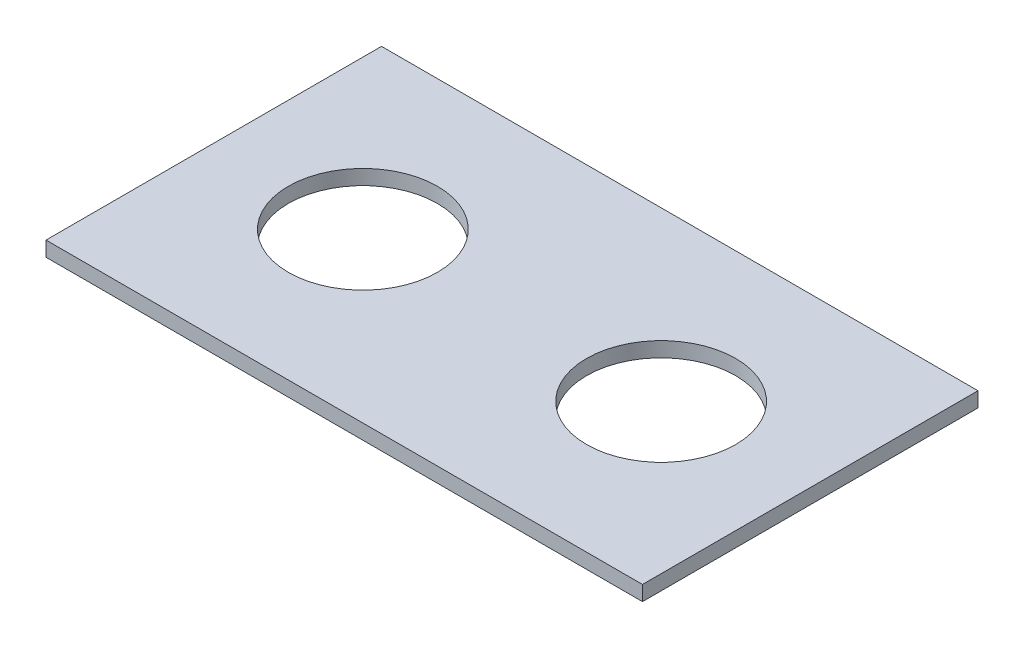
ISO-10303-21;
HEADER;
FILE_DESCRIPTION(('STEP AP214'),'2;1');
FILE_NAME('part.step','',(''),(''),'','','');
FILE_SCHEMA(('AUTOMOTIVE_DESIGN { 1 0 10303 214 1 1 1 1 }'));
ENDSEC;
DATA;
#1=APPLICATION_CONTEXT('core data for automotive mechanical design processes');
#2=APPLICATION_PROTOCOL_DEFINITION('international standard','automotive_design',2000,#1);
#3=PRODUCT_CONTEXT('',#1,'mechanical');
#4=PRODUCT('Part','Part','',(#3));
#5=PRODUCT_RELATED_PRODUCT_CATEGORY('part','',(#4));
#6=PRODUCT_DEFINITION_FORMATION('','',#4);
#7=PRODUCT_DEFINITION_CONTEXT('part definition',#1,'design');
#8=PRODUCT_DEFINITION('design','',#6,#7);
#9=PRODUCT_DEFINITION_SHAPE('','',#8);
#10=(LENGTH_UNIT() NAMED_UNIT(*) SI_UNIT(.MILLI.,.METRE.));
#11=(NAMED_UNIT(*) PLANE_ANGLE_UNIT() SI_UNIT($,.RADIAN.));
#12=(NAMED_UNIT(*) SI_UNIT($,.STERADIAN.) SOLID_ANGLE_UNIT());
#13=UNCERTAINTY_MEASURE_WITH_UNIT(LENGTH_MEASURE(1.E-05),#10,'distance_accuracy_value','');
#14=(GEOMETRIC_REPRESENTATION_CONTEXT(3) GLOBAL_UNCERTAINTY_ASSIGNED_CONTEXT((#13)) GLOBAL_UNIT_ASSIGNED_CONTEXT((#10,
#11,#12)) REPRESENTATION_CONTEXT('',''));
#15=CARTESIAN_POINT('',(0.,0.,0.));
#16=DIRECTION('',(0.,0.,1.));
#17=DIRECTION('',(1.,0.,0.));
#18=AXIS2_PLACEMENT_3D('',#15,#16,#17);
#19=CARTESIAN_POINT('',(-50.8,2.54,28.575));
#20=DIRECTION('',(0.,0.,-1.));
#21=DIRECTION('',(-1.,0.,0.));
#22=AXIS2_PLACEMENT_3D('',#19,#20,#21);
#23=PLANE('',#22);
#24=DIRECTION('',(1.,0.,0.));
#25=VECTOR('',#24,1.);
#26=CARTESIAN_POINT('',(-50.8,0.,28.575));
#27=LINE('',#26,#25);
#28=CARTESIAN_POINT('',(-50.8,0.,28.575));
#29=VERTEX_POINT('',#28);
#30=CARTESIAN_POINT('',(50.8,0.,28.575));
#31=VERTEX_POINT('',#30);
#32=EDGE_CURVE('E111',#29,#31,#27,.T.);
#33=ORIENTED_EDGE('',*,*,#32,.T.);
#34=DIRECTION('',(0.,-1.,0.));
#35=VECTOR('',#34,1.);
#36=CARTESIAN_POINT('',(50.8,2.54,28.575));
#37=LINE('',#36,#35);
#38=CARTESIAN_POINT('',(50.8,2.54,28.575));
#39=VERTEX_POINT('',#38);
#40=EDGE_CURVE('E11',#39,#31,#37,.T.);
#41=ORIENTED_EDGE('',*,*,#40,.F.);
#42=DIRECTION('',(1.,0.,0.));
#43=VECTOR('',#42,1.);
#44=CARTESIAN_POINT('',(-50.8,2.54,28.575));
#45=LINE('',#44,#43);
#46=CARTESIAN_POINT('',(-50.8,2.54,28.575));
#47=VERTEX_POINT('',#46);
#48=EDGE_CURVE('E92',#47,#39,#45,.T.);
#49=ORIENTED_EDGE('',*,*,#48,.F.);
#50=DIRECTION('',(0.,-1.,0.));
#51=VECTOR('',#50,1.);
#52=CARTESIAN_POINT('',(-50.8,2.54,28.575));
#53=LINE('',#52,#51);
#54=EDGE_CURVE('E59',#47,#29,#53,.T.);
#55=ORIENTED_EDGE('',*,*,#54,.T.);
#56=EDGE_LOOP('',(#33,#41,#49,#55));
#57=FACE_BOUND('',#56,.T.);
#58=ADVANCED_FACE('F42',(#57),#23,.F.);
#59=CARTESIAN_POINT('',(50.8,2.54,28.575));
#60=DIRECTION('',(-1.,0.,0.));
#61=DIRECTION('',(0.,0.,1.));
#62=AXIS2_PLACEMENT_3D('',#59,#60,#61);
#63=PLANE('',#62);
#64=DIRECTION('',(0.,0.,-1.));
#65=VECTOR('',#64,1.);
#66=CARTESIAN_POINT('',(50.8,0.,28.575));
#67=LINE('',#66,#65);
#68=CARTESIAN_POINT('',(50.8,0.,-28.575));
#69=VERTEX_POINT('',#68);
#70=EDGE_CURVE('E98',#31,#69,#67,.T.);
#71=ORIENTED_EDGE('',*,*,#70,.T.);
#72=DIRECTION('',(0.,-1.,0.));
#73=VECTOR('',#72,1.);
#74=CARTESIAN_POINT('',(50.8,2.54,-28.575));
#75=LINE('',#74,#73);
#76=CARTESIAN_POINT('',(50.8,2.54,-28.575));
#77=VERTEX_POINT('',#76);
#78=EDGE_CURVE('E51',#77,#69,#75,.T.);
#79=ORIENTED_EDGE('',*,*,#78,.F.);
#80=DIRECTION('',(0.,0.,-1.));
#81=VECTOR('',#80,1.);
#82=CARTESIAN_POINT('',(50.8,2.54,28.575));
#83=LINE('',#82,#81);
#84=EDGE_CURVE('E84',#39,#77,#83,.T.);
#85=ORIENTED_EDGE('',*,*,#84,.F.);
#86=ORIENTED_EDGE('',*,*,#40,.T.);
#87=EDGE_LOOP('',(#71,#79,#85,#86));
#88=FACE_BOUND('',#87,.T.);
#89=ADVANCED_FACE('F97',(#88),#63,.F.);
#90=CARTESIAN_POINT('',(-50.8,2.54,-28.575));
#91=DIRECTION('',(0.,0.,-1.));
#92=DIRECTION('',(-1.,0.,0.));
#93=AXIS2_PLACEMENT_3D('',#90,#91,#92);
#94=PLANE('',#93);
#95=DIRECTION('',(1.,0.,0.));
#96=VECTOR('',#95,1.);
#97=CARTESIAN_POINT('',(-50.8,0.,-28.575));
#98=LINE('',#97,#96);
#99=CARTESIAN_POINT('',(-50.8,0.,-28.575));
#100=VERTEX_POINT('',#99);
#101=EDGE_CURVE('E117',#100,#69,#98,.T.);
#102=ORIENTED_EDGE('',*,*,#101,.F.);
#103=DIRECTION('',(0.,-1.,0.));
#104=VECTOR('',#103,1.);
#105=CARTESIAN_POINT('',(-50.8,2.54,-28.575));
#106=LINE('',#105,#104);
#107=CARTESIAN_POINT('',(-50.8,2.54,-28.575));
#108=VERTEX_POINT('',#107);
#109=EDGE_CURVE('E73',#108,#100,#106,.T.);
#110=ORIENTED_EDGE('',*,*,#109,.F.);
#111=DIRECTION('',(1.,0.,0.));
#112=VECTOR('',#111,1.);
#113=CARTESIAN_POINT('',(-50.8,2.54,-28.575));
#114=LINE('',#113,#112);
#115=EDGE_CURVE('E91',#108,#77,#114,.T.);
#116=ORIENTED_EDGE('',*,*,#115,.T.);
#117=ORIENTED_EDGE('',*,*,#78,.T.);
#118=EDGE_LOOP('',(#102,#110,#116,#117));
#119=FACE_BOUND('',#118,.T.);
#120=ADVANCED_FACE('F102',(#119),#94,.T.);
#121=CARTESIAN_POINT('',(-50.8,2.54,28.575));
#122=DIRECTION('',(-1.,0.,0.));
#123=DIRECTION('',(0.,0.,1.));
#124=AXIS2_PLACEMENT_3D('',#121,#122,#123);
#125=PLANE('',#124);
#126=DIRECTION('',(0.,0.,-1.));
#127=VECTOR('',#126,1.);
#128=CARTESIAN_POINT('',(-50.8,0.,28.575));
#129=LINE('',#128,#127);
#130=EDGE_CURVE('E120',#29,#100,#129,.T.);
#131=ORIENTED_EDGE('',*,*,#130,.F.);
#132=ORIENTED_EDGE('',*,*,#54,.F.);
#133=DIRECTION('',(0.,0.,-1.));
#134=VECTOR('',#133,1.);
#135=CARTESIAN_POINT('',(-50.8,2.54,28.575));
#136=LINE('',#135,#134);
#137=EDGE_CURVE('E104',#47,#108,#136,.T.);
#138=ORIENTED_EDGE('',*,*,#137,.T.);
#139=ORIENTED_EDGE('',*,*,#109,.T.);
#140=EDGE_LOOP('',(#131,#132,#138,#139));
#141=FACE_BOUND('',#140,.T.);
#142=ADVANCED_FACE('F166',(#141),#125,.T.);
#143=CARTESIAN_POINT('',(0.,2.54,0.));
#144=DIRECTION('',(0.,1.,0.));
#145=DIRECTION('',(0.,0.,1.));
#146=AXIS2_PLACEMENT_3D('',#143,#144,#145);
#147=PLANE('',#146);
#148=CARTESIAN_POINT('',(-25.4,2.54,0.));
#149=DIRECTION('',(0.,1.,0.));
#150=DIRECTION('',(0.,0.,1.));
#151=AXIS2_PLACEMENT_3D('',#148,#149,#150);
#152=CIRCLE('',#151,12.7);
#153=CARTESIAN_POINT('',(-25.4,2.54,12.7));
#154=VERTEX_POINT('',#153);
#155=EDGE_CURVE('E145',#154,#154,#152,.T.);
#156=ORIENTED_EDGE('',*,*,#155,.F.);
#157=EDGE_LOOP('',(#156));
#158=FACE_BOUND('',#157,.T.);
#159=CARTESIAN_POINT('',(25.4,2.54,0.));
#160=DIRECTION('',(0.,1.,0.));
#161=DIRECTION('',(0.,0.,-1.));
#162=AXIS2_PLACEMENT_3D('',#159,#160,#161);
#163=CIRCLE('',#162,12.7);
#164=CARTESIAN_POINT('',(25.4,2.54,-12.7));
#165=VERTEX_POINT('',#164);
#166=EDGE_CURVE('E137',#165,#165,#163,.T.);
#167=ORIENTED_EDGE('',*,*,#166,.F.);
#168=EDGE_LOOP('',(#167));
#169=FACE_BOUND('',#168,.T.);
#170=ORIENTED_EDGE('',*,*,#48,.T.);
#171=ORIENTED_EDGE('',*,*,#84,.T.);
#172=ORIENTED_EDGE('',*,*,#115,.F.);
#173=ORIENTED_EDGE('',*,*,#137,.F.);
#174=EDGE_LOOP('',(#170,#171,#172,#173));
#175=FACE_BOUND('',#174,.T.);
#176=ADVANCED_FACE('F88',(#158,#169,#175),#147,.T.);
#177=CARTESIAN_POINT('',(0.,0.,0.));
#178=DIRECTION('',(0.,1.,0.));
#179=DIRECTION('',(0.,0.,1.));
#180=AXIS2_PLACEMENT_3D('',#177,#178,#179);
#181=PLANE('',#180);
#182=CARTESIAN_POINT('',(-25.4,0.,0.));
#183=DIRECTION('',(0.,1.,0.));
#184=DIRECTION('',(0.,0.,1.));
#185=AXIS2_PLACEMENT_3D('',#182,#183,#184);
#186=CIRCLE('',#185,12.7);
#187=CARTESIAN_POINT('',(-25.4,0.,12.7));
#188=VERTEX_POINT('',#187);
#189=EDGE_CURVE('E114',#188,#188,#186,.T.);
#190=ORIENTED_EDGE('',*,*,#189,.T.);
#191=EDGE_LOOP('',(#190));
#192=FACE_BOUND('',#191,.T.);
#193=CARTESIAN_POINT('',(25.4,0.,0.));
#194=DIRECTION('',(0.,1.,0.));
#195=DIRECTION('',(0.,0.,-1.));
#196=AXIS2_PLACEMENT_3D('',#193,#194,#195);
#197=CIRCLE('',#196,12.7);
#198=CARTESIAN_POINT('',(25.4,0.,-12.7));
#199=VERTEX_POINT('',#198);
#200=EDGE_CURVE('E141',#199,#199,#197,.T.);
#201=ORIENTED_EDGE('',*,*,#200,.T.);
#202=EDGE_LOOP('',(#201));
#203=FACE_BOUND('',#202,.T.);
#204=ORIENTED_EDGE('',*,*,#32,.F.);
#205=ORIENTED_EDGE('',*,*,#130,.T.);
#206=ORIENTED_EDGE('',*,*,#101,.T.);
#207=ORIENTED_EDGE('',*,*,#70,.F.);
#208=EDGE_LOOP('',(#204,#205,#206,#207));
#209=FACE_BOUND('',#208,.T.);
#210=ADVANCED_FACE('F154',(#192,#203,#209),#181,.F.);
#211=CARTESIAN_POINT('',(25.4,0.,0.));
#212=DIRECTION('',(0.,1.,0.));
#213=DIRECTION('',(0.,0.,1.));
#214=AXIS2_PLACEMENT_3D('',#211,#212,#213);
#215=CYLINDRICAL_SURFACE('',#214,12.7);
#216=ORIENTED_EDGE('',*,*,#200,.F.);
#217=EDGE_LOOP('',(#216));
#218=FACE_BOUND('',#217,.T.);
#219=ORIENTED_EDGE('',*,*,#166,.T.);
#220=EDGE_LOOP('',(#219));
#221=FACE_BOUND('',#220,.T.);
#222=ADVANCED_FACE('F160',(#218,#221),#215,.F.);
#223=CARTESIAN_POINT('',(-25.4,0.,0.));
#224=DIRECTION('',(0.,1.,0.));
#225=DIRECTION('',(0.,0.,1.));
#226=AXIS2_PLACEMENT_3D('',#223,#224,#225);
#227=CYLINDRICAL_SURFACE('',#226,12.7);
#228=ORIENTED_EDGE('',*,*,#189,.F.);
#229=EDGE_LOOP('',(#228));
#230=FACE_BOUND('',#229,.T.);
#231=ORIENTED_EDGE('',*,*,#155,.T.);
#232=EDGE_LOOP('',(#231));
#233=FACE_BOUND('',#232,.T.);
#234=ADVANCED_FACE('F157',(#230,#233),#227,.F.);
#235=CLOSED_SHELL('',(#58,#89,#120,#142,#176,#210,#222,#234));
#236=MANIFOLD_SOLID_BREP('B2',#235);
#237=ADVANCED_BREP_SHAPE_REPRESENTATION('',(#18,#236),#14);
#238=SHAPE_DEFINITION_REPRESENTATION(#9,#237);
ENDSEC;
END-ISO-10303-21;
